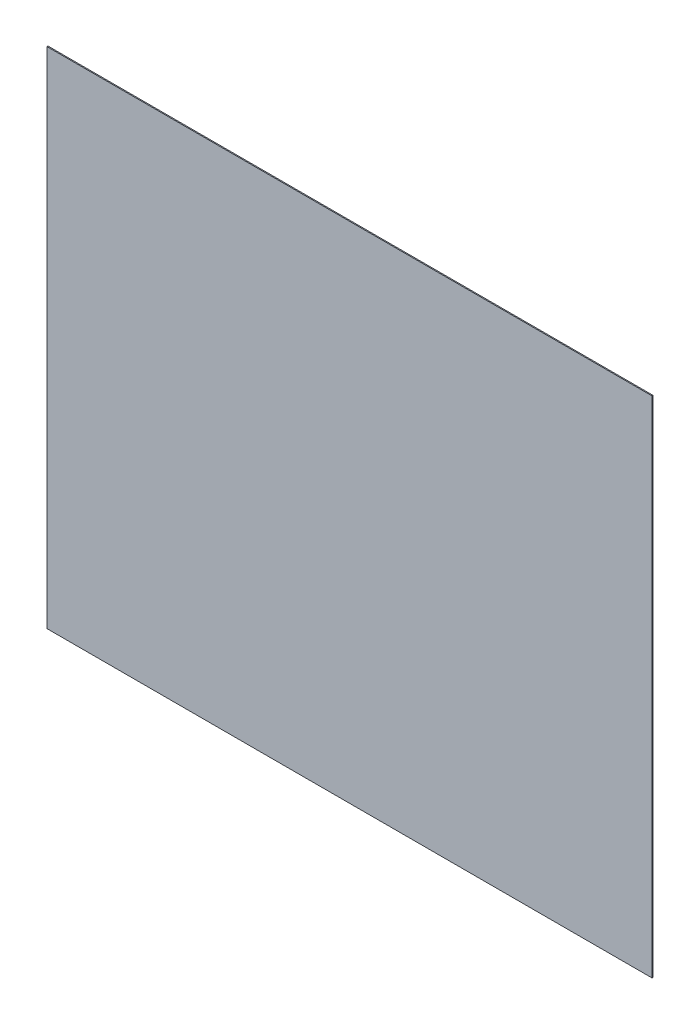
ISO-10303-21;
HEADER;
FILE_DESCRIPTION(('STEP AP214'),'2;1');
FILE_NAME('part.step','',(''),(''),'','','');
FILE_SCHEMA(('AUTOMOTIVE_DESIGN { 1 0 10303 214 1 1 1 1 }'));
ENDSEC;
DATA;
#1=APPLICATION_CONTEXT('core data for automotive mechanical design processes');
#2=APPLICATION_PROTOCOL_DEFINITION('international standard','automotive_design',2000,#1);
#3=PRODUCT_CONTEXT('',#1,'mechanical');
#4=PRODUCT('Part','Part','',(#3));
#5=PRODUCT_RELATED_PRODUCT_CATEGORY('part','',(#4));
#6=PRODUCT_DEFINITION_FORMATION('','',#4);
#7=PRODUCT_DEFINITION_CONTEXT('part definition',#1,'design');
#8=PRODUCT_DEFINITION('design','',#6,#7);
#9=PRODUCT_DEFINITION_SHAPE('','',#8);
#10=(LENGTH_UNIT() NAMED_UNIT(*) SI_UNIT(.MILLI.,.METRE.));
#11=(NAMED_UNIT(*) PLANE_ANGLE_UNIT() SI_UNIT($,.RADIAN.));
#12=(NAMED_UNIT(*) SI_UNIT($,.STERADIAN.) SOLID_ANGLE_UNIT());
#13=UNCERTAINTY_MEASURE_WITH_UNIT(LENGTH_MEASURE(1.E-05),#10,'distance_accuracy_value','');
#14=(GEOMETRIC_REPRESENTATION_CONTEXT(3) GLOBAL_UNCERTAINTY_ASSIGNED_CONTEXT((#13)) GLOBAL_UNIT_ASSIGNED_CONTEXT((#10,
#11,#12)) REPRESENTATION_CONTEXT('',''));
#15=CARTESIAN_POINT('',(0.,0.,0.));
#16=DIRECTION('',(0.,0.,1.));
#17=DIRECTION('',(1.,0.,0.));
#18=AXIS2_PLACEMENT_3D('',#15,#16,#17);
#19=CARTESIAN_POINT('',(2.031834394335E-05,-9.234225583314E-06,0.00100076));
#20=DIRECTION('',(0.,0.,1.));
#21=DIRECTION('',(1.,0.,0.));
#22=AXIS2_PLACEMENT_3D('',#19,#20,#21);
#23=PLANE('',#22);
#24=DIRECTION('',(-1.,0.,0.));
#25=VECTOR('',#24,1.);
#26=CARTESIAN_POINT('',(0.299339,0.2493264,0.00100076));
#27=LINE('',#26,#25);
#28=CARTESIAN_POINT('',(0.299339,0.2493264,0.00100076));
#29=VERTEX_POINT('',#28);
#30=CARTESIAN_POINT('',(-0.29925772,0.2493264,0.00100076));
#31=VERTEX_POINT('',#30);
#32=EDGE_CURVE('E82',#29,#31,#27,.T.);
#33=ORIENTED_EDGE('',*,*,#32,.T.);
#34=DIRECTION('',(-0.00016299918284544,-0.999999986715633,0.));
#35=VECTOR('',#34,1.);
#36=CARTESIAN_POINT('',(-0.29925772,0.2493264,0.00100076));
#37=LINE('',#36,#35);
#38=CARTESIAN_POINT('',(-0.299339,-0.2493264,0.00100076));
#39=VERTEX_POINT('',#38);
#40=EDGE_CURVE('E98',#31,#39,#37,.T.);
#41=ORIENTED_EDGE('',*,*,#40,.T.);
#42=DIRECTION('',(1.,0.,0.));
#43=VECTOR('',#42,1.);
#44=CARTESIAN_POINT('',(-0.299339,-0.2493264,0.00100076));
#45=LINE('',#44,#43);
#46=CARTESIAN_POINT('',(0.299339,-0.2493264,0.00100076));
#47=VERTEX_POINT('',#46);
#48=EDGE_CURVE('E74',#39,#47,#45,.T.);
#49=ORIENTED_EDGE('',*,*,#48,.T.);
#50=DIRECTION('',(0.,1.,0.));
#51=VECTOR('',#50,1.);
#52=CARTESIAN_POINT('',(0.299339,-0.2493264,0.00100076));
#53=LINE('',#52,#51);
#54=EDGE_CURVE('E11',#47,#29,#53,.T.);
#55=ORIENTED_EDGE('',*,*,#54,.T.);
#56=EDGE_LOOP('',(#33,#41,#49,#55));
#57=FACE_BOUND('',#56,.T.);
#58=ADVANCED_FACE('F17',(#57),#23,.T.);
#59=CARTESIAN_POINT('',(2.031834394335E-05,-9.234225583314E-06,0.));
#60=DIRECTION('',(0.,0.,1.));
#61=DIRECTION('',(1.,0.,0.));
#62=AXIS2_PLACEMENT_3D('',#59,#60,#61);
#63=PLANE('',#62);
#64=DIRECTION('',(0.,1.,0.));
#65=VECTOR('',#64,1.);
#66=CARTESIAN_POINT('',(0.299339,-0.2493264,0.));
#67=LINE('',#66,#65);
#68=CARTESIAN_POINT('',(0.299339,-0.2493264,0.));
#69=VERTEX_POINT('',#68);
#70=CARTESIAN_POINT('',(0.299339,0.2493264,0.));
#71=VERTEX_POINT('',#70);
#72=EDGE_CURVE('E25',#69,#71,#67,.T.);
#73=ORIENTED_EDGE('',*,*,#72,.F.);
#74=DIRECTION('',(1.,0.,0.));
#75=VECTOR('',#74,1.);
#76=CARTESIAN_POINT('',(-0.299339,-0.2493264,0.));
#77=LINE('',#76,#75);
#78=CARTESIAN_POINT('',(-0.299339,-0.2493264,0.));
#79=VERTEX_POINT('',#78);
#80=EDGE_CURVE('E102',#79,#69,#77,.T.);
#81=ORIENTED_EDGE('',*,*,#80,.F.);
#82=DIRECTION('',(-0.00016299918284544,-0.999999986715633,0.));
#83=VECTOR('',#82,1.);
#84=CARTESIAN_POINT('',(-0.29925772,0.2493264,0.));
#85=LINE('',#84,#83);
#86=CARTESIAN_POINT('',(-0.29925772,0.2493264,0.));
#87=VERTEX_POINT('',#86);
#88=EDGE_CURVE('E84',#87,#79,#85,.T.);
#89=ORIENTED_EDGE('',*,*,#88,.F.);
#90=DIRECTION('',(-1.,0.,0.));
#91=VECTOR('',#90,1.);
#92=CARTESIAN_POINT('',(0.299339,0.2493264,0.));
#93=LINE('',#92,#91);
#94=EDGE_CURVE('E80',#71,#87,#93,.T.);
#95=ORIENTED_EDGE('',*,*,#94,.F.);
#96=EDGE_LOOP('',(#73,#81,#89,#95));
#97=FACE_BOUND('',#96,.T.);
#98=ADVANCED_FACE('F86',(#97),#63,.F.);
#99=CARTESIAN_POINT('',(0.299339,-0.2493264,0.));
#100=DIRECTION('',(-1.,0.,0.));
#101=DIRECTION('',(0.,0.,1.));
#102=AXIS2_PLACEMENT_3D('',#99,#100,#101);
#103=PLANE('',#102);
#104=ORIENTED_EDGE('',*,*,#72,.T.);
#105=DIRECTION('',(0.,0.,1.));
#106=VECTOR('',#105,1.);
#107=CARTESIAN_POINT('',(0.299339,0.2493264,0.));
#108=LINE('',#107,#106);
#109=EDGE_CURVE('E68',#71,#29,#108,.T.);
#110=ORIENTED_EDGE('',*,*,#109,.T.);
#111=ORIENTED_EDGE('',*,*,#54,.F.);
#112=DIRECTION('',(0.,0.,1.));
#113=VECTOR('',#112,1.);
#114=CARTESIAN_POINT('',(0.299339,-0.2493264,0.));
#115=LINE('',#114,#113);
#116=EDGE_CURVE('E71',#69,#47,#115,.T.);
#117=ORIENTED_EDGE('',*,*,#116,.F.);
#118=EDGE_LOOP('',(#104,#110,#111,#117));
#119=FACE_BOUND('',#118,.T.);
#120=ADVANCED_FACE('F67',(#119),#103,.F.);
#121=CARTESIAN_POINT('',(-0.299339,-0.2493264,0.));
#122=DIRECTION('',(0.,1.,0.));
#123=DIRECTION('',(1.,0.,0.));
#124=AXIS2_PLACEMENT_3D('',#121,#122,#123);
#125=PLANE('',#124);
#126=ORIENTED_EDGE('',*,*,#80,.T.);
#127=ORIENTED_EDGE('',*,*,#116,.T.);
#128=ORIENTED_EDGE('',*,*,#48,.F.);
#129=DIRECTION('',(0.,0.,1.));
#130=VECTOR('',#129,1.);
#131=CARTESIAN_POINT('',(-0.299339,-0.2493264,0.));
#132=LINE('',#131,#130);
#133=EDGE_CURVE('E103',#79,#39,#132,.T.);
#134=ORIENTED_EDGE('',*,*,#133,.F.);
#135=EDGE_LOOP('',(#126,#127,#128,#134));
#136=FACE_BOUND('',#135,.T.);
#137=ADVANCED_FACE('F117',(#136),#125,.F.);
#138=CARTESIAN_POINT('',(-0.29925772,0.2493264,0.));
#139=DIRECTION('',(0.999999986715633,-0.00016299918284544,0.));
#140=DIRECTION('',(0.,0.,-1.));
#141=AXIS2_PLACEMENT_3D('',#138,#139,#140);
#142=PLANE('',#141);
#143=ORIENTED_EDGE('',*,*,#88,.T.);
#144=ORIENTED_EDGE('',*,*,#133,.T.);
#145=ORIENTED_EDGE('',*,*,#40,.F.);
#146=DIRECTION('',(0.,0.,1.));
#147=VECTOR('',#146,1.);
#148=CARTESIAN_POINT('',(-0.29925772,0.2493264,0.));
#149=LINE('',#148,#147);
#150=EDGE_CURVE('E90',#87,#31,#149,.T.);
#151=ORIENTED_EDGE('',*,*,#150,.F.);
#152=EDGE_LOOP('',(#143,#144,#145,#151));
#153=FACE_BOUND('',#152,.T.);
#154=ADVANCED_FACE('F119',(#153),#142,.F.);
#155=CARTESIAN_POINT('',(0.299339,0.2493264,0.));
#156=DIRECTION('',(0.,-1.,0.));
#157=DIRECTION('',(0.,0.,-1.));
#158=AXIS2_PLACEMENT_3D('',#155,#156,#157);
#159=PLANE('',#158);
#160=ORIENTED_EDGE('',*,*,#94,.T.);
#161=ORIENTED_EDGE('',*,*,#150,.T.);
#162=ORIENTED_EDGE('',*,*,#32,.F.);
#163=ORIENTED_EDGE('',*,*,#109,.F.);
#164=EDGE_LOOP('',(#160,#161,#162,#163));
#165=FACE_BOUND('',#164,.T.);
#166=ADVANCED_FACE('F78',(#165),#159,.F.);
#167=CLOSED_SHELL('',(#58,#98,#120,#137,#154,#166));
#168=MANIFOLD_SOLID_BREP('B1',#167);
#169=ADVANCED_BREP_SHAPE_REPRESENTATION('',(#18,#168),#14);
#170=SHAPE_DEFINITION_REPRESENTATION(#9,#169);
ENDSEC;
END-ISO-10303-21;
